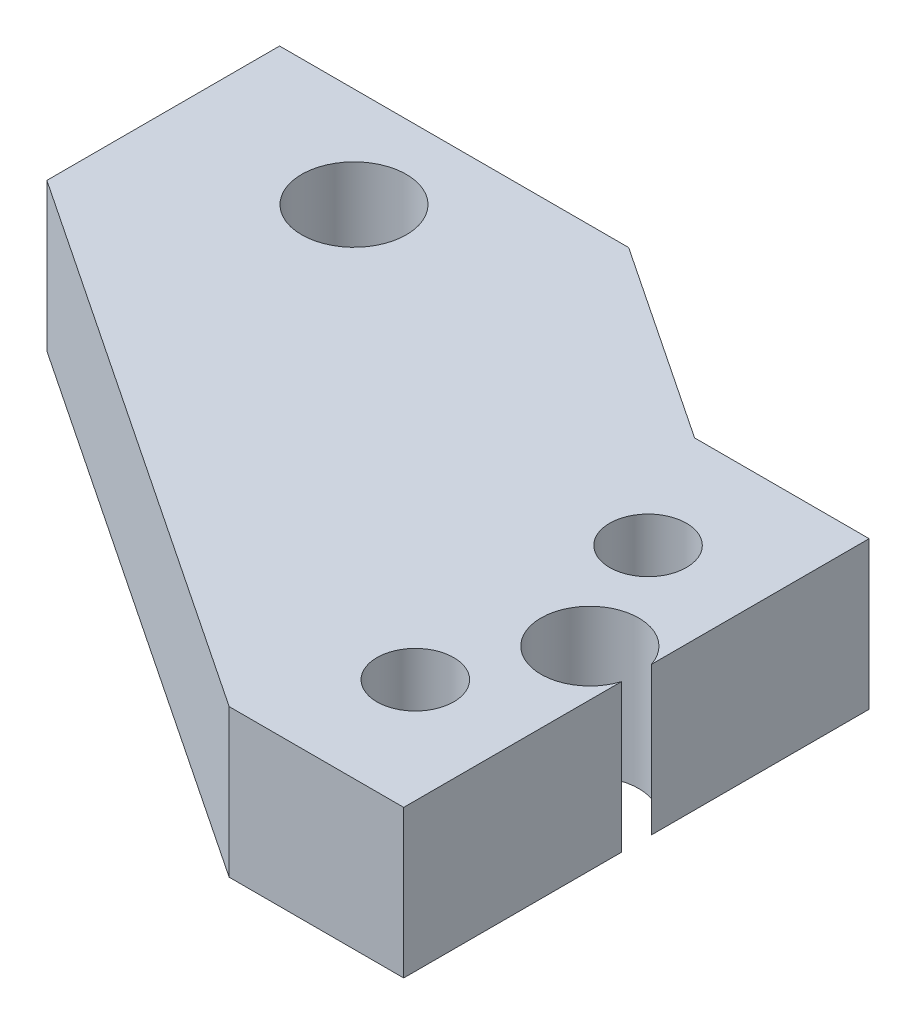
ISO-10303-21;
HEADER;
FILE_DESCRIPTION(('STEP AP214'),'2;1');
FILE_NAME('part.step','',(''),(''),'','','');
FILE_SCHEMA(('AUTOMOTIVE_DESIGN { 1 0 10303 214 1 1 1 1 }'));
ENDSEC;
DATA;
#1=APPLICATION_CONTEXT('core data for automotive mechanical design processes');
#2=APPLICATION_PROTOCOL_DEFINITION('international standard','automotive_design',2000,#1);
#3=PRODUCT_CONTEXT('',#1,'mechanical');
#4=PRODUCT('Part','Part','',(#3));
#5=PRODUCT_RELATED_PRODUCT_CATEGORY('part','',(#4));
#6=PRODUCT_DEFINITION_FORMATION('','',#4);
#7=PRODUCT_DEFINITION_CONTEXT('part definition',#1,'design');
#8=PRODUCT_DEFINITION('design','',#6,#7);
#9=PRODUCT_DEFINITION_SHAPE('','',#8);
#10=(LENGTH_UNIT() NAMED_UNIT(*) SI_UNIT(.MILLI.,.METRE.));
#11=(NAMED_UNIT(*) PLANE_ANGLE_UNIT() SI_UNIT($,.RADIAN.));
#12=(NAMED_UNIT(*) SI_UNIT($,.STERADIAN.) SOLID_ANGLE_UNIT());
#13=UNCERTAINTY_MEASURE_WITH_UNIT(LENGTH_MEASURE(1.E-05),#10,'distance_accuracy_value','');
#14=(GEOMETRIC_REPRESENTATION_CONTEXT(3) GLOBAL_UNCERTAINTY_ASSIGNED_CONTEXT((#13)) GLOBAL_UNIT_ASSIGNED_CONTEXT((#10,
#11,#12)) REPRESENTATION_CONTEXT('',''));
#15=CARTESIAN_POINT('',(0.,0.,0.));
#16=DIRECTION('',(0.,0.,1.));
#17=DIRECTION('',(1.,0.,0.));
#18=AXIS2_PLACEMENT_3D('',#15,#16,#17);
#19=CARTESIAN_POINT('',(0.,3.175,0.));
#20=DIRECTION('',(-1.,0.,0.));
#21=DIRECTION('',(0.,0.,1.));
#22=AXIS2_PLACEMENT_3D('',#19,#20,#21);
#23=PLANE('',#22);
#24=DIRECTION('',(0.,0.,-1.));
#25=VECTOR('',#24,1.);
#26=CARTESIAN_POINT('',(0.,-3.175,0.));
#27=LINE('',#26,#25);
#28=CARTESIAN_POINT('',(0.,-3.175,0.));
#29=VERTEX_POINT('',#28);
#30=CARTESIAN_POINT('',(0.,-3.175,-9.35968757625638));
#31=VERTEX_POINT('',#30);
#32=EDGE_CURVE('E163',#29,#31,#27,.T.);
#33=ORIENTED_EDGE('',*,*,#32,.T.);
#34=DIRECTION('',(0.,1.,0.));
#35=VECTOR('',#34,1.);
#36=CARTESIAN_POINT('',(0.,3.175,-9.35968757625638));
#37=LINE('',#36,#35);
#38=CARTESIAN_POINT('',(0.,3.175,-9.35968757625638));
#39=VERTEX_POINT('',#38);
#40=EDGE_CURVE('E11',#31,#39,#37,.T.);
#41=ORIENTED_EDGE('',*,*,#40,.T.);
#42=DIRECTION('',(0.,0.,-1.));
#43=VECTOR('',#42,1.);
#44=CARTESIAN_POINT('',(0.,3.175,0.));
#45=LINE('',#44,#43);
#46=CARTESIAN_POINT('',(0.,3.175,0.));
#47=VERTEX_POINT('',#46);
#48=EDGE_CURVE('E115',#47,#39,#45,.T.);
#49=ORIENTED_EDGE('',*,*,#48,.F.);
#50=DIRECTION('',(0.,-1.,0.));
#51=VECTOR('',#50,1.);
#52=CARTESIAN_POINT('',(0.,3.175,0.));
#53=LINE('',#52,#51);
#54=EDGE_CURVE('E184',#47,#29,#53,.T.);
#55=ORIENTED_EDGE('',*,*,#54,.T.);
#56=EDGE_LOOP('',(#33,#41,#49,#55));
#57=FACE_BOUND('',#56,.T.);
#58=ADVANCED_FACE('F53',(#57),#23,.F.);
#59=CARTESIAN_POINT('',(-7.5,3.175,0.));
#60=DIRECTION('',(0.,0.,-1.));
#61=DIRECTION('',(-1.,0.,0.));
#62=AXIS2_PLACEMENT_3D('',#59,#60,#61);
#63=PLANE('',#62);
#64=DIRECTION('',(1.,0.,0.));
#65=VECTOR('',#64,1.);
#66=CARTESIAN_POINT('',(-7.5,-3.175,0.));
#67=LINE('',#66,#65);
#68=CARTESIAN_POINT('',(-7.5,-3.175,0.));
#69=VERTEX_POINT('',#68);
#70=EDGE_CURVE('E158',#69,#29,#67,.T.);
#71=ORIENTED_EDGE('',*,*,#70,.T.);
#72=ORIENTED_EDGE('',*,*,#54,.F.);
#73=DIRECTION('',(1.,0.,0.));
#74=VECTOR('',#73,1.);
#75=CARTESIAN_POINT('',(-7.5,3.175,0.));
#76=LINE('',#75,#74);
#77=CARTESIAN_POINT('',(-7.5,3.175,0.));
#78=VERTEX_POINT('',#77);
#79=EDGE_CURVE('E174',#78,#47,#76,.T.);
#80=ORIENTED_EDGE('',*,*,#79,.F.);
#81=DIRECTION('',(0.,-1.,0.));
#82=VECTOR('',#81,1.);
#83=CARTESIAN_POINT('',(-7.5,3.175,0.));
#84=LINE('',#83,#82);
#85=EDGE_CURVE('E154',#78,#69,#84,.T.);
#86=ORIENTED_EDGE('',*,*,#85,.T.);
#87=EDGE_LOOP('',(#71,#72,#80,#86));
#88=FACE_BOUND('',#87,.T.);
#89=ADVANCED_FACE('F55',(#88),#63,.F.);
#90=CARTESIAN_POINT('',(0.,3.175,-10.6403124237439));
#91=VERTEX_POINT('',#90);
#92=CARTESIAN_POINT('',(0.,3.175,-20.));
#93=VERTEX_POINT('',#92);
#94=EDGE_CURVE('E190',#91,#93,#45,.T.);
#95=ORIENTED_EDGE('',*,*,#94,.F.);
#96=DIRECTION('',(0.,1.,0.));
#97=VECTOR('',#96,1.);
#98=CARTESIAN_POINT('',(0.,3.175,-10.6403124237439));
#99=LINE('',#98,#97);
#100=CARTESIAN_POINT('',(0.,-3.175,-10.6403124237439));
#101=VERTEX_POINT('',#100);
#102=EDGE_CURVE('E61',#91,#101,#99,.F.);
#103=ORIENTED_EDGE('',*,*,#102,.T.);
#104=CARTESIAN_POINT('',(0.,-3.175,-20.));
#105=VERTEX_POINT('',#104);
#106=EDGE_CURVE('E161',#101,#105,#27,.T.);
#107=ORIENTED_EDGE('',*,*,#106,.T.);
#108=DIRECTION('',(0.,-1.,0.));
#109=VECTOR('',#108,1.);
#110=CARTESIAN_POINT('',(0.,3.175,-20.));
#111=LINE('',#110,#109);
#112=EDGE_CURVE('E181',#93,#105,#111,.T.);
#113=ORIENTED_EDGE('',*,*,#112,.F.);
#114=EDGE_LOOP('',(#95,#103,#107,#113));
#115=FACE_BOUND('',#114,.T.);
#116=ADVANCED_FACE('F188',(#115),#23,.F.);
#117=CARTESIAN_POINT('',(0.,3.175,-20.));
#118=DIRECTION('',(0.,0.,1.));
#119=DIRECTION('',(1.,0.,0.));
#120=AXIS2_PLACEMENT_3D('',#117,#118,#119);
#121=PLANE('',#120);
#122=DIRECTION('',(-1.,0.,0.));
#123=VECTOR('',#122,1.);
#124=CARTESIAN_POINT('',(0.,-3.175,-20.));
#125=LINE('',#124,#123);
#126=CARTESIAN_POINT('',(-7.5,-3.175,-20.));
#127=VERTEX_POINT('',#126);
#128=EDGE_CURVE('E166',#105,#127,#125,.T.);
#129=ORIENTED_EDGE('',*,*,#128,.T.);
#130=DIRECTION('',(0.,-1.,0.));
#131=VECTOR('',#130,1.);
#132=CARTESIAN_POINT('',(-7.5,3.175,-20.));
#133=LINE('',#132,#131);
#134=CARTESIAN_POINT('',(-7.5,3.175,-20.));
#135=VERTEX_POINT('',#134);
#136=EDGE_CURVE('E178',#135,#127,#133,.T.);
#137=ORIENTED_EDGE('',*,*,#136,.F.);
#138=DIRECTION('',(-1.,0.,0.));
#139=VECTOR('',#138,1.);
#140=CARTESIAN_POINT('',(0.,3.175,-20.));
#141=LINE('',#140,#139);
#142=EDGE_CURVE('E203',#93,#135,#141,.T.);
#143=ORIENTED_EDGE('',*,*,#142,.F.);
#144=ORIENTED_EDGE('',*,*,#112,.T.);
#145=EDGE_LOOP('',(#129,#137,#143,#144));
#146=FACE_BOUND('',#145,.T.);
#147=ADVANCED_FACE('F199',(#146),#121,.F.);
#148=CARTESIAN_POINT('',(-7.5,3.175,-20.));
#149=DIRECTION('',(-0.554700196225229,0.,0.832050294337844));
#150=DIRECTION('',(0.832050294337844,0.,0.554700196225229));
#151=AXIS2_PLACEMENT_3D('',#148,#149,#150);
#152=PLANE('',#151);
#153=DIRECTION('',(-0.832050294337844,0.,-0.554700196225229));
#154=VECTOR('',#153,1.);
#155=CARTESIAN_POINT('',(-7.5,-3.175,-20.));
#156=LINE('',#155,#154);
#157=CARTESIAN_POINT('',(-16.,-3.175,-25.6666666666667));
#158=VERTEX_POINT('',#157);
#159=EDGE_CURVE('E168',#127,#158,#156,.T.);
#160=ORIENTED_EDGE('',*,*,#159,.T.);
#161=DIRECTION('',(0.,-1.,0.));
#162=VECTOR('',#161,1.);
#163=CARTESIAN_POINT('',(-16.,3.175,-25.6666666666667));
#164=LINE('',#163,#162);
#165=CARTESIAN_POINT('',(-16.,3.175,-25.6666666666667));
#166=VERTEX_POINT('',#165);
#167=EDGE_CURVE('E149',#166,#158,#164,.T.);
#168=ORIENTED_EDGE('',*,*,#167,.F.);
#169=DIRECTION('',(-0.832050294337844,0.,-0.554700196225229));
#170=VECTOR('',#169,1.);
#171=CARTESIAN_POINT('',(-7.5,3.175,-20.));
#172=LINE('',#171,#170);
#173=EDGE_CURVE('E137',#135,#166,#172,.T.);
#174=ORIENTED_EDGE('',*,*,#173,.F.);
#175=ORIENTED_EDGE('',*,*,#136,.T.);
#176=EDGE_LOOP('',(#160,#168,#174,#175));
#177=FACE_BOUND('',#176,.T.);
#178=ADVANCED_FACE('F202',(#177),#152,.F.);
#179=CARTESIAN_POINT('',(-16.,3.175,-25.6666666666667));
#180=DIRECTION('',(0.,0.,1.));
#181=DIRECTION('',(1.,0.,0.));
#182=AXIS2_PLACEMENT_3D('',#179,#180,#181);
#183=PLANE('',#182);
#184=DIRECTION('',(-1.,0.,0.));
#185=VECTOR('',#184,1.);
#186=CARTESIAN_POINT('',(-16.,-3.175,-25.6666666666667));
#187=LINE('',#186,#185);
#188=CARTESIAN_POINT('',(-31.,-3.175,-25.6666666666667));
#189=VERTEX_POINT('',#188);
#190=EDGE_CURVE('E146',#158,#189,#187,.T.);
#191=ORIENTED_EDGE('',*,*,#190,.T.);
#192=DIRECTION('',(0.,-1.,0.));
#193=VECTOR('',#192,1.);
#194=CARTESIAN_POINT('',(-31.,3.175,-25.6666666666667));
#195=LINE('',#194,#193);
#196=CARTESIAN_POINT('',(-31.,3.175,-25.6666666666667));
#197=VERTEX_POINT('',#196);
#198=EDGE_CURVE('E143',#197,#189,#195,.T.);
#199=ORIENTED_EDGE('',*,*,#198,.F.);
#200=DIRECTION('',(-1.,0.,0.));
#201=VECTOR('',#200,1.);
#202=CARTESIAN_POINT('',(-16.,3.175,-25.6666666666667));
#203=LINE('',#202,#201);
#204=EDGE_CURVE('E128',#166,#197,#203,.T.);
#205=ORIENTED_EDGE('',*,*,#204,.F.);
#206=ORIENTED_EDGE('',*,*,#167,.T.);
#207=EDGE_LOOP('',(#191,#199,#205,#206));
#208=FACE_BOUND('',#207,.T.);
#209=ADVANCED_FACE('F144',(#208),#183,.F.);
#210=CARTESIAN_POINT('',(-31.,3.175,-25.6666666666667));
#211=DIRECTION('',(1.,0.,0.));
#212=DIRECTION('',(0.,0.,-1.));
#213=AXIS2_PLACEMENT_3D('',#210,#211,#212);
#214=PLANE('',#213);
#215=DIRECTION('',(0.,0.,1.));
#216=VECTOR('',#215,1.);
#217=CARTESIAN_POINT('',(-31.,-3.175,-25.6666666666667));
#218=LINE('',#217,#216);
#219=CARTESIAN_POINT('',(-31.,-3.175,-15.6666666666667));
#220=VERTEX_POINT('',#219);
#221=EDGE_CURVE('E171',#189,#220,#218,.T.);
#222=ORIENTED_EDGE('',*,*,#221,.T.);
#223=DIRECTION('',(0.,-1.,0.));
#224=VECTOR('',#223,1.);
#225=CARTESIAN_POINT('',(-31.,3.175,-15.6666666666667));
#226=LINE('',#225,#224);
#227=CARTESIAN_POINT('',(-31.,3.175,-15.6666666666667));
#228=VERTEX_POINT('',#227);
#229=EDGE_CURVE('E150',#228,#220,#226,.T.);
#230=ORIENTED_EDGE('',*,*,#229,.F.);
#231=DIRECTION('',(0.,0.,1.));
#232=VECTOR('',#231,1.);
#233=CARTESIAN_POINT('',(-31.,3.175,-25.6666666666667));
#234=LINE('',#233,#232);
#235=EDGE_CURVE('E134',#197,#228,#234,.T.);
#236=ORIENTED_EDGE('',*,*,#235,.F.);
#237=ORIENTED_EDGE('',*,*,#198,.T.);
#238=EDGE_LOOP('',(#222,#230,#236,#237));
#239=FACE_BOUND('',#238,.T.);
#240=ADVANCED_FACE('F152',(#239),#214,.F.);
#241=CARTESIAN_POINT('',(-31.,3.175,-15.6666666666667));
#242=DIRECTION('',(0.554700196225229,0.,-0.832050294337844));
#243=DIRECTION('',(-0.832050294337844,0.,-0.554700196225229));
#244=AXIS2_PLACEMENT_3D('',#241,#242,#243);
#245=PLANE('',#244);
#246=DIRECTION('',(0.832050294337844,0.,0.554700196225229));
#247=VECTOR('',#246,1.);
#248=CARTESIAN_POINT('',(-31.,-3.175,-15.6666666666667));
#249=LINE('',#248,#247);
#250=EDGE_CURVE('E107',#220,#69,#249,.T.);
#251=ORIENTED_EDGE('',*,*,#250,.T.);
#252=ORIENTED_EDGE('',*,*,#85,.F.);
#253=DIRECTION('',(0.832050294337844,0.,0.554700196225229));
#254=VECTOR('',#253,1.);
#255=CARTESIAN_POINT('',(-31.,3.175,-15.6666666666667));
#256=LINE('',#255,#254);
#257=EDGE_CURVE('E77',#228,#78,#256,.T.);
#258=ORIENTED_EDGE('',*,*,#257,.F.);
#259=ORIENTED_EDGE('',*,*,#229,.T.);
#260=EDGE_LOOP('',(#251,#252,#258,#259));
#261=FACE_BOUND('',#260,.T.);
#262=ADVANCED_FACE('F233',(#261),#245,.F.);
#263=CARTESIAN_POINT('',(0.,3.175,0.));
#264=DIRECTION('',(0.,1.,0.));
#265=DIRECTION('',(0.,0.,1.));
#266=AXIS2_PLACEMENT_3D('',#263,#264,#265);
#267=PLANE('',#266);
#268=CARTESIAN_POINT('',(-1.99999999999985,3.175,-10.0000000000001));
#269=DIRECTION('',(0.,1.,0.));
#270=DIRECTION('',(0.,0.,1.));
#271=AXIS2_PLACEMENT_3D('',#268,#269,#270);
#272=CIRCLE('',#271,2.1);
#273=EDGE_CURVE('E226',#91,#39,#272,.T.);
#274=ORIENTED_EDGE('',*,*,#273,.F.);
#275=ORIENTED_EDGE('',*,*,#94,.T.);
#276=ORIENTED_EDGE('',*,*,#142,.T.);
#277=ORIENTED_EDGE('',*,*,#173,.T.);
#278=ORIENTED_EDGE('',*,*,#204,.T.);
#279=ORIENTED_EDGE('',*,*,#235,.T.);
#280=ORIENTED_EDGE('',*,*,#257,.T.);
#281=ORIENTED_EDGE('',*,*,#79,.T.);
#282=ORIENTED_EDGE('',*,*,#48,.T.);
#283=EDGE_LOOP('',(#274,#275,#276,#277,#278,#279,#280,#281,#282));
#284=FACE_BOUND('',#283,.T.);
#285=CARTESIAN_POINT('',(-4.50000044703468,3.175,-15.));
#286=DIRECTION('',(0.,1.,0.));
#287=DIRECTION('',(0.,0.,1.));
#288=AXIS2_PLACEMENT_3D('',#285,#286,#287);
#289=CIRCLE('',#288,1.65);
#290=CARTESIAN_POINT('',(-4.50000044703468,3.175,-13.35));
#291=VERTEX_POINT('',#290);
#292=EDGE_CURVE('E222',#291,#291,#289,.T.);
#293=ORIENTED_EDGE('',*,*,#292,.F.);
#294=EDGE_LOOP('',(#293));
#295=FACE_BOUND('',#294,.T.);
#296=CARTESIAN_POINT('',(-4.50000044703468,3.175,-4.99999999999999));
#297=DIRECTION('',(0.,1.,0.));
#298=DIRECTION('',(0.,0.,1.));
#299=AXIS2_PLACEMENT_3D('',#296,#297,#298);
#300=CIRCLE('',#299,1.65);
#301=CARTESIAN_POINT('',(-4.50000044703468,3.175,-3.34999999999999));
#302=VERTEX_POINT('',#301);
#303=EDGE_CURVE('E216',#302,#302,#300,.T.);
#304=ORIENTED_EDGE('',*,*,#303,.F.);
#305=EDGE_LOOP('',(#304));
#306=FACE_BOUND('',#305,.T.);
#307=CARTESIAN_POINT('',(-23.5,3.175,-21.3644712743404));
#308=DIRECTION('',(0.,1.,0.));
#309=DIRECTION('',(0.,0.,1.));
#310=AXIS2_PLACEMENT_3D('',#307,#308,#309);
#311=CIRCLE('',#310,2.25);
#312=CARTESIAN_POINT('',(-23.5,3.175,-19.1144712743404));
#313=VERTEX_POINT('',#312);
#314=EDGE_CURVE('E210',#313,#313,#311,.T.);
#315=ORIENTED_EDGE('',*,*,#314,.F.);
#316=EDGE_LOOP('',(#315));
#317=FACE_BOUND('',#316,.T.);
#318=ADVANCED_FACE('F131',(#284,#295,#306,#317),#267,.T.);
#319=CARTESIAN_POINT('',(0.,-3.175,0.));
#320=DIRECTION('',(0.,1.,0.));
#321=DIRECTION('',(0.,0.,1.));
#322=AXIS2_PLACEMENT_3D('',#319,#320,#321);
#323=PLANE('',#322);
#324=CARTESIAN_POINT('',(-4.50000044703468,-3.175,-15.));
#325=DIRECTION('',(0.,1.,0.));
#326=DIRECTION('',(0.,0.,1.));
#327=AXIS2_PLACEMENT_3D('',#324,#325,#326);
#328=CIRCLE('',#327,1.65);
#329=CARTESIAN_POINT('',(-4.50000044703468,-3.175,-13.35));
#330=VERTEX_POINT('',#329);
#331=EDGE_CURVE('E219',#330,#330,#328,.T.);
#332=ORIENTED_EDGE('',*,*,#331,.T.);
#333=EDGE_LOOP('',(#332));
#334=FACE_BOUND('',#333,.T.);
#335=CARTESIAN_POINT('',(-4.50000044703468,-3.175,-4.99999999999999));
#336=DIRECTION('',(0.,1.,0.));
#337=DIRECTION('',(0.,0.,1.));
#338=AXIS2_PLACEMENT_3D('',#335,#336,#337);
#339=CIRCLE('',#338,1.65);
#340=CARTESIAN_POINT('',(-4.50000044703468,-3.175,-3.34999999999999));
#341=VERTEX_POINT('',#340);
#342=EDGE_CURVE('E213',#341,#341,#339,.T.);
#343=ORIENTED_EDGE('',*,*,#342,.T.);
#344=EDGE_LOOP('',(#343));
#345=FACE_BOUND('',#344,.T.);
#346=CARTESIAN_POINT('',(-23.5,-3.175,-21.3644712743404));
#347=DIRECTION('',(0.,1.,0.));
#348=DIRECTION('',(0.,0.,1.));
#349=AXIS2_PLACEMENT_3D('',#346,#347,#348);
#350=CIRCLE('',#349,2.25);
#351=CARTESIAN_POINT('',(-23.5,-3.175,-19.1144712743404));
#352=VERTEX_POINT('',#351);
#353=EDGE_CURVE('E162',#352,#352,#350,.T.);
#354=ORIENTED_EDGE('',*,*,#353,.T.);
#355=EDGE_LOOP('',(#354));
#356=FACE_BOUND('',#355,.T.);
#357=ORIENTED_EDGE('',*,*,#106,.F.);
#358=CARTESIAN_POINT('',(-1.99999999999985,-3.175,-10.0000000000001));
#359=DIRECTION('',(0.,1.,0.));
#360=DIRECTION('',(0.,0.,1.));
#361=AXIS2_PLACEMENT_3D('',#358,#359,#360);
#362=CIRCLE('',#361,2.1);
#363=EDGE_CURVE('E68',#101,#31,#362,.T.);
#364=ORIENTED_EDGE('',*,*,#363,.T.);
#365=ORIENTED_EDGE('',*,*,#32,.F.);
#366=ORIENTED_EDGE('',*,*,#70,.F.);
#367=ORIENTED_EDGE('',*,*,#250,.F.);
#368=ORIENTED_EDGE('',*,*,#221,.F.);
#369=ORIENTED_EDGE('',*,*,#190,.F.);
#370=ORIENTED_EDGE('',*,*,#159,.F.);
#371=ORIENTED_EDGE('',*,*,#128,.F.);
#372=EDGE_LOOP('',(#357,#364,#365,#366,#367,#368,#369,#370,#371));
#373=FACE_BOUND('',#372,.T.);
#374=ADVANCED_FACE('F194',(#334,#345,#356,#373),#323,.F.);
#375=CARTESIAN_POINT('',(-23.5,3.175,-21.3644712743404));
#376=DIRECTION('',(0.,1.,0.));
#377=DIRECTION('',(0.,0.,1.));
#378=AXIS2_PLACEMENT_3D('',#375,#376,#377);
#379=CYLINDRICAL_SURFACE('',#378,2.25);
#380=ORIENTED_EDGE('',*,*,#353,.F.);
#381=EDGE_LOOP('',(#380));
#382=FACE_BOUND('',#381,.T.);
#383=ORIENTED_EDGE('',*,*,#314,.T.);
#384=EDGE_LOOP('',(#383));
#385=FACE_BOUND('',#384,.T.);
#386=ADVANCED_FACE('F286',(#382,#385),#379,.F.);
#387=CARTESIAN_POINT('',(-4.50000044703468,3.175,-4.99999999999999));
#388=DIRECTION('',(0.,1.,0.));
#389=DIRECTION('',(0.,0.,1.));
#390=AXIS2_PLACEMENT_3D('',#387,#388,#389);
#391=CYLINDRICAL_SURFACE('',#390,1.65);
#392=ORIENTED_EDGE('',*,*,#342,.F.);
#393=EDGE_LOOP('',(#392));
#394=FACE_BOUND('',#393,.T.);
#395=ORIENTED_EDGE('',*,*,#303,.T.);
#396=EDGE_LOOP('',(#395));
#397=FACE_BOUND('',#396,.T.);
#398=ADVANCED_FACE('F293',(#394,#397),#391,.F.);
#399=CARTESIAN_POINT('',(-4.50000044703468,3.175,-15.));
#400=DIRECTION('',(0.,1.,0.));
#401=DIRECTION('',(0.,0.,1.));
#402=AXIS2_PLACEMENT_3D('',#399,#400,#401);
#403=CYLINDRICAL_SURFACE('',#402,1.65);
#404=ORIENTED_EDGE('',*,*,#331,.F.);
#405=EDGE_LOOP('',(#404));
#406=FACE_BOUND('',#405,.T.);
#407=ORIENTED_EDGE('',*,*,#292,.T.);
#408=EDGE_LOOP('',(#407));
#409=FACE_BOUND('',#408,.T.);
#410=ADVANCED_FACE('F302',(#406,#409),#403,.F.);
#411=CARTESIAN_POINT('',(-1.99999999999985,3.175,-10.0000000000001));
#412=DIRECTION('',(0.,1.,0.));
#413=DIRECTION('',(0.,0.,1.));
#414=AXIS2_PLACEMENT_3D('',#411,#412,#413);
#415=CYLINDRICAL_SURFACE('',#414,2.1);
#416=ORIENTED_EDGE('',*,*,#363,.F.);
#417=ORIENTED_EDGE('',*,*,#102,.F.);
#418=ORIENTED_EDGE('',*,*,#273,.T.);
#419=ORIENTED_EDGE('',*,*,#40,.F.);
#420=EDGE_LOOP('',(#416,#417,#418,#419));
#421=FACE_BOUND('',#420,.T.);
#422=ADVANCED_FACE('F228',(#421),#415,.F.);
#423=CLOSED_SHELL('',(#58,#89,#116,#147,#178,#209,#240,#262,#318,#374,#386,#398,#410,#422));
#424=MANIFOLD_SOLID_BREP('B2',#423);
#425=ADVANCED_BREP_SHAPE_REPRESENTATION('',(#18,#424),#14);
#426=SHAPE_DEFINITION_REPRESENTATION(#9,#425);
ENDSEC;
END-ISO-10303-21;
